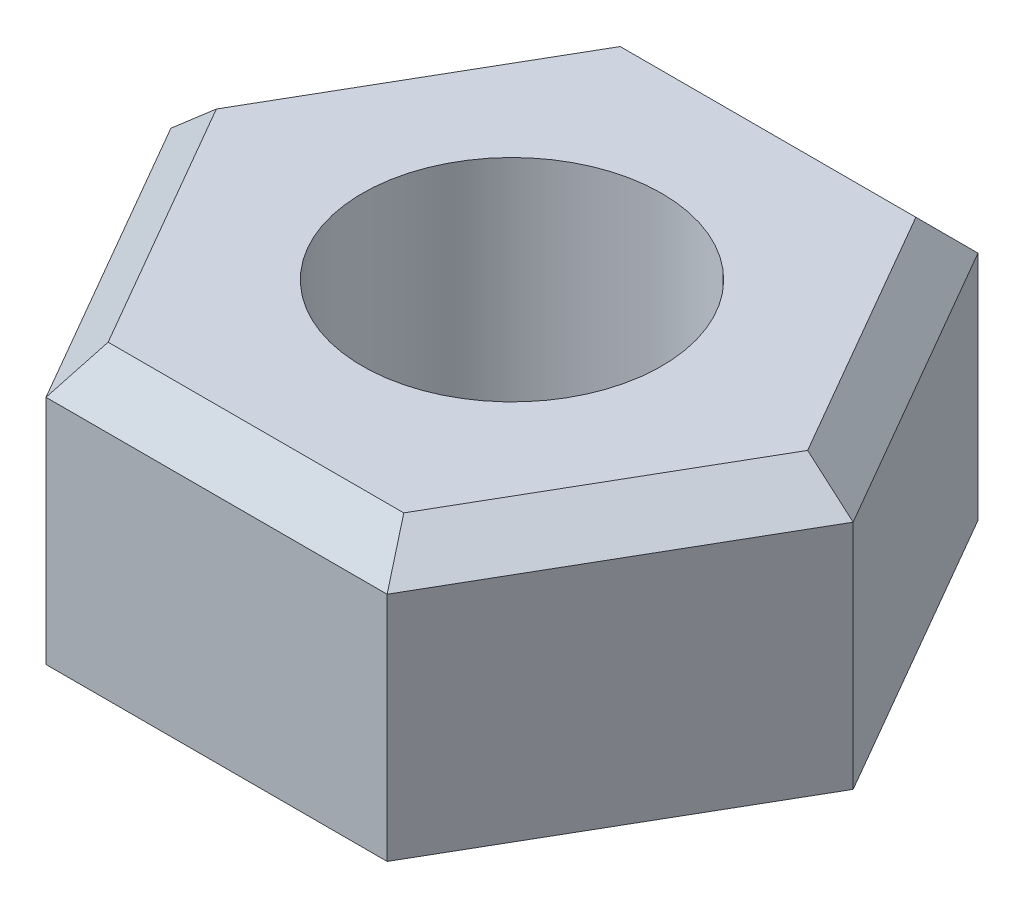
ISO-10303-21;
HEADER;
FILE_DESCRIPTION(('STEP AP214'),'2;1');
FILE_NAME('part.step','',(''),(''),'','','');
FILE_SCHEMA(('AUTOMOTIVE_DESIGN { 1 0 10303 214 1 1 1 1 }'));
ENDSEC;
DATA;
#1=APPLICATION_CONTEXT('core data for automotive mechanical design processes');
#2=APPLICATION_PROTOCOL_DEFINITION('international standard','automotive_design',2000,#1);
#3=PRODUCT_CONTEXT('',#1,'mechanical');
#4=PRODUCT('Part','Part','',(#3));
#5=PRODUCT_RELATED_PRODUCT_CATEGORY('part','',(#4));
#6=PRODUCT_DEFINITION_FORMATION('','',#4);
#7=PRODUCT_DEFINITION_CONTEXT('part definition',#1,'design');
#8=PRODUCT_DEFINITION('design','',#6,#7);
#9=PRODUCT_DEFINITION_SHAPE('','',#8);
#10=(LENGTH_UNIT() NAMED_UNIT(*) SI_UNIT(.MILLI.,.METRE.));
#11=(NAMED_UNIT(*) PLANE_ANGLE_UNIT() SI_UNIT($,.RADIAN.));
#12=(NAMED_UNIT(*) SI_UNIT($,.STERADIAN.) SOLID_ANGLE_UNIT());
#13=UNCERTAINTY_MEASURE_WITH_UNIT(LENGTH_MEASURE(1.E-05),#10,'distance_accuracy_value','');
#14=(GEOMETRIC_REPRESENTATION_CONTEXT(3) GLOBAL_UNCERTAINTY_ASSIGNED_CONTEXT((#13)) GLOBAL_UNIT_ASSIGNED_CONTEXT((#10,
#11,#12)) REPRESENTATION_CONTEXT('',''));
#15=CARTESIAN_POINT('',(0.,0.,0.));
#16=DIRECTION('',(0.,0.,1.));
#17=DIRECTION('',(1.,0.,0.));
#18=AXIS2_PLACEMENT_3D('',#15,#16,#17);
#19=CARTESIAN_POINT('',(-2.782626225,3.730625,-4.7625));
#20=DIRECTION('',(0.,0.707106781186548,-0.707106781186547));
#21=DIRECTION('',(0.,0.707106781186547,0.707106781186548));
#22=AXIS2_PLACEMENT_3D('',#19,#20,#21);
#23=PLANE('',#22);
#24=DIRECTION('',(-1.,0.,0.));
#25=VECTOR('',#24,1.);
#26=CARTESIAN_POINT('',(0.,3.730625,-4.7625));
#27=LINE('',#26,#25);
#28=CARTESIAN_POINT('',(2.74963065731726,3.73062499996767,-4.76249999938583));
#29=VERTEX_POINT('',#28);
#30=CARTESIAN_POINT('',(-2.74963065731782,3.73062499996832,-4.76249999938616));
#31=VERTEX_POINT('',#30);
#32=EDGE_CURVE('E95',#29,#31,#27,.T.);
#33=ORIENTED_EDGE('',*,*,#32,.T.);
#34=DIRECTION('',(-0.377964474744115,-0.654653671392034,-0.654653669022282));
#35=VECTOR('',#34,1.);
#36=CARTESIAN_POINT('',(-2.38301323589874,4.36562499891526,-4.12750000199725));
#37=LINE('',#36,#35);
#38=CARTESIAN_POINT('',(-2.38301323494991,4.36562500008826,-4.12750000023561));
#39=VERTEX_POINT('',#38);
#40=EDGE_CURVE('E21',#39,#31,#37,.T.);
#41=ORIENTED_EDGE('',*,*,#40,.F.);
#42=DIRECTION('',(-1.,0.,0.));
#43=VECTOR('',#42,1.);
#44=CARTESIAN_POINT('',(0.,4.365625,-4.1275));
#45=LINE('',#44,#43);
#46=CARTESIAN_POINT('',(2.38301323493693,4.36562500007326,-4.12750000022812));
#47=VERTEX_POINT('',#46);
#48=EDGE_CURVE('E82',#47,#39,#45,.T.);
#49=ORIENTED_EDGE('',*,*,#48,.F.);
#50=DIRECTION('',(-0.377964474795356,0.654653671332868,0.654653669051865));
#51=VECTOR('',#50,1.);
#52=CARTESIAN_POINT('',(2.74963065750842,3.73062499999212,-4.76249999861791));
#53=LINE('',#52,#51);
#54=EDGE_CURVE('E110',#29,#47,#53,.T.);
#55=ORIENTED_EDGE('',*,*,#54,.F.);
#56=EDGE_LOOP('',(#33,#41,#49,#55));
#57=FACE_BOUND('',#56,.T.);
#58=ADVANCED_FACE('F17',(#57),#23,.T.);
#59=CARTESIAN_POINT('',(-2.206251265,4.186917857,-4.791075));
#60=DIRECTION('',(-0.612372435585481,0.707106781220205,-0.353553390717027));
#61=DIRECTION('',(-0.755928946092235,-0.654653670622782,0.));
#62=AXIS2_PLACEMENT_3D('',#59,#60,#61);
#63=PLANE('',#62);
#64=DIRECTION('',(-0.499999999997874,0.,0.866025403785666));
#65=VECTOR('',#64,1.);
#66=CARTESIAN_POINT('',(-4.1244459855,3.730625,-2.38125));
#67=LINE('',#66,#65);
#68=CARTESIAN_POINT('',(-5.49926131350214,3.73062500055238,0.));
#69=VERTEX_POINT('',#68);
#70=EDGE_CURVE('E175',#31,#69,#67,.T.);
#71=ORIENTED_EDGE('',*,*,#70,.T.);
#72=DIRECTION('',(-0.755928945939426,-0.654653670799231,0.));
#73=VECTOR('',#72,1.);
#74=CARTESIAN_POINT('',(-4.4517829685,4.6377678575,0.));
#75=LINE('',#74,#73);
#76=CARTESIAN_POINT('',(-4.76602647036285,4.36562500027351,-1.36755408423382E-10));
#77=VERTEX_POINT('',#76);
#78=EDGE_CURVE('E100',#77,#69,#75,.T.);
#79=ORIENTED_EDGE('',*,*,#78,.F.);
#80=DIRECTION('',(-0.499999999827506,0.,0.866025403884028));
#81=VECTOR('',#80,1.);
#82=CARTESIAN_POINT('',(-2.38301323498403,4.365625,-4.1275));
#83=LINE('',#82,#81);
#84=EDGE_CURVE('E86',#39,#77,#83,.T.);
#85=ORIENTED_EDGE('',*,*,#84,.F.);
#86=ORIENTED_EDGE('',*,*,#40,.T.);
#87=EDGE_LOOP('',(#71,#79,#85,#86));
#88=FACE_BOUND('',#87,.T.);
#89=ADVANCED_FACE('F101',(#88),#63,.T.);
#90=CARTESIAN_POINT('',(-3.391734883,5.555796429,0.));
#91=DIRECTION('',(-0.612372435750534,0.707106781077265,0.353553390717027));
#92=DIRECTION('',(-0.755928945939426,-0.654653670799231,0.));
#93=AXIS2_PLACEMENT_3D('',#90,#91,#92);
#94=PLANE('',#93);
#95=DIRECTION('',(0.499999999997874,0.,0.866025403785666));
#96=VECTOR('',#95,1.);
#97=CARTESIAN_POINT('',(-4.1244459855,3.730625,2.38125));
#98=LINE('',#97,#96);
#99=CARTESIAN_POINT('',(-2.7496306563754,3.730625,4.7625));
#100=VERTEX_POINT('',#99);
#101=EDGE_CURVE('E165',#69,#100,#98,.T.);
#102=ORIENTED_EDGE('',*,*,#101,.T.);
#103=DIRECTION('',(-0.377964473843778,-0.654653670467062,0.654653670467064));
#104=VECTOR('',#103,1.);
#105=CARTESIAN_POINT('',(-2.38301323387098,4.365625,4.1275));
#106=LINE('',#105,#104);
#107=CARTESIAN_POINT('',(-2.38301323442751,4.365625,4.1275));
#108=VERTEX_POINT('',#107);
#109=EDGE_CURVE('E115',#108,#100,#106,.T.);
#110=ORIENTED_EDGE('',*,*,#109,.F.);
#111=DIRECTION('',(0.499999999827506,0.,0.866025403884028));
#112=VECTOR('',#111,1.);
#113=CARTESIAN_POINT('',(-4.76602646996807,4.365625,0.));
#114=LINE('',#113,#112);
#115=EDGE_CURVE('E104',#77,#108,#114,.T.);
#116=ORIENTED_EDGE('',*,*,#115,.F.);
#117=ORIENTED_EDGE('',*,*,#78,.T.);
#118=EDGE_LOOP('',(#102,#110,#116,#117));
#119=FACE_BOUND('',#118,.T.);
#120=ADVANCED_FACE('F206',(#119),#94,.T.);
#121=CARTESIAN_POINT('',(-2.782626225,4.365625,4.1275));
#122=DIRECTION('',(0.,0.707106781186548,0.707106781186547));
#123=DIRECTION('',(0.,-0.707106781186547,0.707106781186548));
#124=AXIS2_PLACEMENT_3D('',#121,#122,#123);
#125=PLANE('',#124);
#126=DIRECTION('',(1.,0.,0.));
#127=VECTOR('',#126,1.);
#128=CARTESIAN_POINT('',(0.,4.365625,4.1275));
#129=LINE('',#128,#127);
#130=CARTESIAN_POINT('',(2.38301323503012,4.36562500018087,4.12750000028193));
#131=VERTEX_POINT('',#130);
#132=EDGE_CURVE('E106',#108,#131,#129,.T.);
#133=ORIENTED_EDGE('',*,*,#132,.F.);
#134=ORIENTED_EDGE('',*,*,#109,.T.);
#135=DIRECTION('',(1.,0.,0.));
#136=VECTOR('',#135,1.);
#137=CARTESIAN_POINT('',(0.,3.730625,4.7625));
#138=LINE('',#137,#136);
#139=CARTESIAN_POINT('',(2.7496306573873,3.73062500004854,4.76249999942627));
#140=VERTEX_POINT('',#139);
#141=EDGE_CURVE('E112',#100,#140,#138,.T.);
#142=ORIENTED_EDGE('',*,*,#141,.T.);
#143=DIRECTION('',(0.377964474699851,-0.654653671443148,0.654653668996724));
#144=VECTOR('',#143,1.);
#145=CARTESIAN_POINT('',(2.38301323621958,4.36562499928573,4.12750000218249));
#146=LINE('',#145,#144);
#147=EDGE_CURVE('E114',#131,#140,#146,.T.);
#148=ORIENTED_EDGE('',*,*,#147,.F.);
#149=EDGE_LOOP('',(#133,#134,#142,#148));
#150=FACE_BOUND('',#149,.T.);
#151=ADVANCED_FACE('F204',(#150),#125,.T.);
#152=CARTESIAN_POINT('',(5.511831054,3.719739286,0.));
#153=DIRECTION('',(0.612372435778207,0.707106781109219,0.353553390605188));
#154=DIRECTION('',(-0.755928945939426,0.654653670799231,0.));
#155=AXIS2_PLACEMENT_3D('',#152,#153,#154);
#156=PLANE('',#155);
#157=DIRECTION('',(0.499999999827506,0.,-0.866025403884028));
#158=VECTOR('',#157,1.);
#159=CARTESIAN_POINT('',(2.38301323498403,4.365625,4.1275));
#160=LINE('',#159,#158);
#161=CARTESIAN_POINT('',(4.76602647036285,4.36562500027351,-1.36755175979601E-10));
#162=VERTEX_POINT('',#161);
#163=EDGE_CURVE('E152',#131,#162,#160,.T.);
#164=ORIENTED_EDGE('',*,*,#163,.F.);
#165=ORIENTED_EDGE('',*,*,#147,.T.);
#166=DIRECTION('',(0.499999999997874,0.,-0.866025403785666));
#167=VECTOR('',#166,1.);
#168=CARTESIAN_POINT('',(4.1244459855,3.730625,2.38125));
#169=LINE('',#168,#167);
#170=CARTESIAN_POINT('',(5.49926131350214,3.73062500055238,0.));
#171=VERTEX_POINT('',#170);
#172=EDGE_CURVE('E162',#140,#171,#169,.T.);
#173=ORIENTED_EDGE('',*,*,#172,.T.);
#174=DIRECTION('',(0.755928945939426,-0.654653670799231,0.));
#175=VECTOR('',#174,1.);
#176=CARTESIAN_POINT('',(4.4517829685,4.6377678575,0.));
#177=LINE('',#176,#175);
#178=EDGE_CURVE('E113',#162,#171,#177,.T.);
#179=ORIENTED_EDGE('',*,*,#178,.F.);
#180=EDGE_LOOP('',(#164,#165,#173,#179));
#181=FACE_BOUND('',#180,.T.);
#182=ADVANCED_FACE('F199',(#181),#156,.T.);
#183=CARTESIAN_POINT('',(4.326347437,2.350860714,-4.791075));
#184=DIRECTION('',(0.612372435613154,0.707106781252159,-0.353553390605188));
#185=DIRECTION('',(-0.755928946092235,0.654653670622782,0.));
#186=AXIS2_PLACEMENT_3D('',#183,#184,#185);
#187=PLANE('',#186);
#188=DIRECTION('',(-0.499999999997874,0.,-0.866025403785666));
#189=VECTOR('',#188,1.);
#190=CARTESIAN_POINT('',(4.1244459855,3.730625,-2.38125));
#191=LINE('',#190,#189);
#192=EDGE_CURVE('E137',#171,#29,#191,.T.);
#193=ORIENTED_EDGE('',*,*,#192,.T.);
#194=ORIENTED_EDGE('',*,*,#54,.T.);
#195=DIRECTION('',(-0.499999999827506,0.,-0.866025403884028));
#196=VECTOR('',#195,1.);
#197=CARTESIAN_POINT('',(4.76602646996807,4.365625,0.));
#198=LINE('',#197,#196);
#199=EDGE_CURVE('E89',#162,#47,#198,.T.);
#200=ORIENTED_EDGE('',*,*,#199,.F.);
#201=ORIENTED_EDGE('',*,*,#178,.T.);
#202=EDGE_LOOP('',(#193,#194,#200,#201));
#203=FACE_BOUND('',#202,.T.);
#204=ADVANCED_FACE('F195',(#203),#187,.T.);
#205=CARTESIAN_POINT('',(2.749630657,0.,4.7625));
#206=DIRECTION('',(0.,0.,-1.));
#207=DIRECTION('',(-1.,0.,0.));
#208=AXIS2_PLACEMENT_3D('',#205,#206,#207);
#209=PLANE('',#208);
#210=DIRECTION('',(1.,0.,0.));
#211=VECTOR('',#210,1.);
#212=CARTESIAN_POINT('',(0.,0.,4.7625));
#213=LINE('',#212,#211);
#214=CARTESIAN_POINT('',(-2.749630657,0.,4.7625));
#215=VERTEX_POINT('',#214);
#216=CARTESIAN_POINT('',(2.749630657,0.,4.7625));
#217=VERTEX_POINT('',#216);
#218=EDGE_CURVE('E138',#215,#217,#213,.T.);
#219=ORIENTED_EDGE('',*,*,#218,.T.);
#220=DIRECTION('',(0.,1.,0.));
#221=VECTOR('',#220,1.);
#222=CARTESIAN_POINT('',(2.749630657,1.8653125,4.7625));
#223=LINE('',#222,#221);
#224=EDGE_CURVE('E169',#217,#140,#223,.T.);
#225=ORIENTED_EDGE('',*,*,#224,.T.);
#226=ORIENTED_EDGE('',*,*,#141,.F.);
#227=DIRECTION('',(0.,-1.,0.));
#228=VECTOR('',#227,1.);
#229=CARTESIAN_POINT('',(-2.749630657,1.8653125,4.7625));
#230=LINE('',#229,#228);
#231=EDGE_CURVE('E133',#100,#215,#230,.T.);
#232=ORIENTED_EDGE('',*,*,#231,.T.);
#233=EDGE_LOOP('',(#219,#225,#226,#232));
#234=FACE_BOUND('',#233,.T.);
#235=ADVANCED_FACE('F203',(#234),#209,.F.);
#236=CARTESIAN_POINT('',(5.499261314,0.,0.));
#237=DIRECTION('',(-0.866025403785666,0.,-0.499999999997874));
#238=DIRECTION('',(-0.499999999997874,0.,0.866025403785666));
#239=AXIS2_PLACEMENT_3D('',#236,#237,#238);
#240=PLANE('',#239);
#241=DIRECTION('',(-0.499999999997874,0.,0.866025403785666));
#242=VECTOR('',#241,1.);
#243=CARTESIAN_POINT('',(5.499261314,0.,0.));
#244=LINE('',#243,#242);
#245=CARTESIAN_POINT('',(5.499261314,0.,0.));
#246=VERTEX_POINT('',#245);
#247=EDGE_CURVE('E140',#217,#246,#244,.F.);
#248=ORIENTED_EDGE('',*,*,#247,.T.);
#249=DIRECTION('',(0.,1.,0.));
#250=VECTOR('',#249,1.);
#251=CARTESIAN_POINT('',(5.499261314,1.8653125,0.));
#252=LINE('',#251,#250);
#253=EDGE_CURVE('E134',#246,#171,#252,.T.);
#254=ORIENTED_EDGE('',*,*,#253,.T.);
#255=ORIENTED_EDGE('',*,*,#172,.F.);
#256=ORIENTED_EDGE('',*,*,#224,.F.);
#257=EDGE_LOOP('',(#248,#254,#255,#256));
#258=FACE_BOUND('',#257,.T.);
#259=ADVANCED_FACE('F201',(#258),#240,.F.);
#260=CARTESIAN_POINT('',(2.749630657,0.,-4.7625));
#261=DIRECTION('',(-0.866025403785666,0.,0.499999999997874));
#262=DIRECTION('',(0.499999999997874,0.,0.866025403785666));
#263=AXIS2_PLACEMENT_3D('',#260,#261,#262);
#264=PLANE('',#263);
#265=DIRECTION('',(0.499999999997874,0.,0.866025403785666));
#266=VECTOR('',#265,1.);
#267=CARTESIAN_POINT('',(2.749630657,0.,-4.7625));
#268=LINE('',#267,#266);
#269=CARTESIAN_POINT('',(2.749630657,0.,-4.7625));
#270=VERTEX_POINT('',#269);
#271=EDGE_CURVE('E131',#246,#270,#268,.F.);
#272=ORIENTED_EDGE('',*,*,#271,.T.);
#273=DIRECTION('',(0.,1.,0.));
#274=VECTOR('',#273,1.);
#275=CARTESIAN_POINT('',(2.749630657,1.8653125,-4.7625));
#276=LINE('',#275,#274);
#277=EDGE_CURVE('E173',#270,#29,#276,.T.);
#278=ORIENTED_EDGE('',*,*,#277,.T.);
#279=ORIENTED_EDGE('',*,*,#192,.F.);
#280=ORIENTED_EDGE('',*,*,#253,.F.);
#281=EDGE_LOOP('',(#272,#278,#279,#280));
#282=FACE_BOUND('',#281,.T.);
#283=ADVANCED_FACE('F197',(#282),#264,.F.);
#284=CARTESIAN_POINT('',(-2.749630657,0.,-4.7625));
#285=DIRECTION('',(0.,0.,1.));
#286=DIRECTION('',(1.,0.,0.));
#287=AXIS2_PLACEMENT_3D('',#284,#285,#286);
#288=PLANE('',#287);
#289=DIRECTION('',(-1.,0.,0.));
#290=VECTOR('',#289,1.);
#291=CARTESIAN_POINT('',(0.,0.,-4.7625));
#292=LINE('',#291,#290);
#293=CARTESIAN_POINT('',(-2.749630657,0.,-4.7625));
#294=VERTEX_POINT('',#293);
#295=EDGE_CURVE('E127',#270,#294,#292,.T.);
#296=ORIENTED_EDGE('',*,*,#295,.T.);
#297=DIRECTION('',(0.,1.,0.));
#298=VECTOR('',#297,1.);
#299=CARTESIAN_POINT('',(-2.749630657,1.8653125,-4.7625));
#300=LINE('',#299,#298);
#301=EDGE_CURVE('E159',#294,#31,#300,.T.);
#302=ORIENTED_EDGE('',*,*,#301,.T.);
#303=ORIENTED_EDGE('',*,*,#32,.F.);
#304=ORIENTED_EDGE('',*,*,#277,.F.);
#305=EDGE_LOOP('',(#296,#302,#303,#304));
#306=FACE_BOUND('',#305,.T.);
#307=ADVANCED_FACE('F180',(#306),#288,.F.);
#308=CARTESIAN_POINT('',(-5.499261314,0.,0.));
#309=DIRECTION('',(0.866025403785666,0.,0.499999999997874));
#310=DIRECTION('',(0.499999999997874,0.,-0.866025403785666));
#311=AXIS2_PLACEMENT_3D('',#308,#309,#310);
#312=PLANE('',#311);
#313=DIRECTION('',(0.499999999997874,0.,-0.866025403785666));
#314=VECTOR('',#313,1.);
#315=CARTESIAN_POINT('',(-5.499261314,0.,0.));
#316=LINE('',#315,#314);
#317=CARTESIAN_POINT('',(-5.499261314,0.,0.));
#318=VERTEX_POINT('',#317);
#319=EDGE_CURVE('E130',#294,#318,#316,.F.);
#320=ORIENTED_EDGE('',*,*,#319,.T.);
#321=DIRECTION('',(0.,1.,0.));
#322=VECTOR('',#321,1.);
#323=CARTESIAN_POINT('',(-5.499261314,1.8653125,0.));
#324=LINE('',#323,#322);
#325=EDGE_CURVE('E36',#318,#69,#324,.T.);
#326=ORIENTED_EDGE('',*,*,#325,.T.);
#327=ORIENTED_EDGE('',*,*,#70,.F.);
#328=ORIENTED_EDGE('',*,*,#301,.F.);
#329=EDGE_LOOP('',(#320,#326,#327,#328));
#330=FACE_BOUND('',#329,.T.);
#331=ADVANCED_FACE('F184',(#330),#312,.F.);
#332=CARTESIAN_POINT('',(-2.749630657,0.,4.7625));
#333=DIRECTION('',(0.866025403785666,0.,-0.499999999997874));
#334=DIRECTION('',(-0.499999999997874,0.,-0.866025403785666));
#335=AXIS2_PLACEMENT_3D('',#332,#333,#334);
#336=PLANE('',#335);
#337=DIRECTION('',(-0.499999999997874,0.,-0.866025403785666));
#338=VECTOR('',#337,1.);
#339=CARTESIAN_POINT('',(-2.749630657,0.,4.7625));
#340=LINE('',#339,#338);
#341=EDGE_CURVE('E144',#318,#215,#340,.F.);
#342=ORIENTED_EDGE('',*,*,#341,.T.);
#343=ORIENTED_EDGE('',*,*,#231,.F.);
#344=ORIENTED_EDGE('',*,*,#101,.F.);
#345=ORIENTED_EDGE('',*,*,#325,.F.);
#346=EDGE_LOOP('',(#342,#343,#344,#345));
#347=FACE_BOUND('',#346,.T.);
#348=ADVANCED_FACE('F190',(#347),#336,.F.);
#349=CARTESIAN_POINT('',(-4.82321879,4.365625,-4.1275));
#350=DIRECTION('',(0.,1.,0.));
#351=DIRECTION('',(0.,0.,1.));
#352=AXIS2_PLACEMENT_3D('',#349,#350,#351);
#353=PLANE('',#352);
#354=CARTESIAN_POINT('',(0.,4.365625,0.));
#355=DIRECTION('',(0.,-1.,0.));
#356=DIRECTION('',(0.,0.,-1.));
#357=AXIS2_PLACEMENT_3D('',#354,#355,#356);
#358=CIRCLE('',#357,2.413);
#359=CARTESIAN_POINT('',(0.,4.365625,-2.413));
#360=VERTEX_POINT('',#359);
#361=EDGE_CURVE('E27',#360,#360,#358,.F.);
#362=ORIENTED_EDGE('',*,*,#361,.F.);
#363=EDGE_LOOP('',(#362));
#364=FACE_BOUND('',#363,.T.);
#365=ORIENTED_EDGE('',*,*,#163,.T.);
#366=ORIENTED_EDGE('',*,*,#199,.T.);
#367=ORIENTED_EDGE('',*,*,#48,.T.);
#368=ORIENTED_EDGE('',*,*,#84,.T.);
#369=ORIENTED_EDGE('',*,*,#115,.T.);
#370=ORIENTED_EDGE('',*,*,#132,.T.);
#371=EDGE_LOOP('',(#365,#366,#367,#368,#369,#370));
#372=FACE_BOUND('',#371,.T.);
#373=ADVANCED_FACE('F84',(#364,#372),#353,.T.);
#374=CARTESIAN_POINT('',(-5.56525245,0.,-4.7625));
#375=DIRECTION('',(0.,1.,0.));
#376=DIRECTION('',(0.,0.,1.));
#377=AXIS2_PLACEMENT_3D('',#374,#375,#376);
#378=PLANE('',#377);
#379=CARTESIAN_POINT('',(0.,0.,0.));
#380=DIRECTION('',(0.,-1.,0.));
#381=DIRECTION('',(0.,0.,-1.));
#382=AXIS2_PLACEMENT_3D('',#379,#380,#381);
#383=CIRCLE('',#382,2.413);
#384=CARTESIAN_POINT('',(0.,0.,-2.413));
#385=VERTEX_POINT('',#384);
#386=EDGE_CURVE('E11',#385,#385,#383,.T.);
#387=ORIENTED_EDGE('',*,*,#386,.F.);
#388=EDGE_LOOP('',(#387));
#389=FACE_BOUND('',#388,.T.);
#390=ORIENTED_EDGE('',*,*,#319,.F.);
#391=ORIENTED_EDGE('',*,*,#295,.F.);
#392=ORIENTED_EDGE('',*,*,#271,.F.);
#393=ORIENTED_EDGE('',*,*,#247,.F.);
#394=ORIENTED_EDGE('',*,*,#218,.F.);
#395=ORIENTED_EDGE('',*,*,#341,.F.);
#396=EDGE_LOOP('',(#390,#391,#392,#393,#394,#395));
#397=FACE_BOUND('',#396,.T.);
#398=ADVANCED_FACE('F19',(#389,#397),#378,.F.);
#399=CARTESIAN_POINT('',(0.,4.365625,0.));
#400=DIRECTION('',(0.,-1.,0.));
#401=DIRECTION('',(0.,0.,-1.));
#402=AXIS2_PLACEMENT_3D('',#399,#400,#401);
#403=CYLINDRICAL_SURFACE('',#402,2.413);
#404=ORIENTED_EDGE('',*,*,#386,.T.);
#405=EDGE_LOOP('',(#404));
#406=FACE_BOUND('',#405,.T.);
#407=ORIENTED_EDGE('',*,*,#361,.T.);
#408=EDGE_LOOP('',(#407));
#409=FACE_BOUND('',#408,.T.);
#410=ADVANCED_FACE('F215',(#406,#409),#403,.F.);
#411=CLOSED_SHELL('',(#58,#89,#120,#151,#182,#204,#235,#259,#283,#307,#331,#348,#373,#398,#410));
#412=MANIFOLD_SOLID_BREP('B1',#411);
#413=ADVANCED_BREP_SHAPE_REPRESENTATION('',(#18,#412),#14);
#414=SHAPE_DEFINITION_REPRESENTATION(#9,#413);
ENDSEC;
END-ISO-10303-21;
